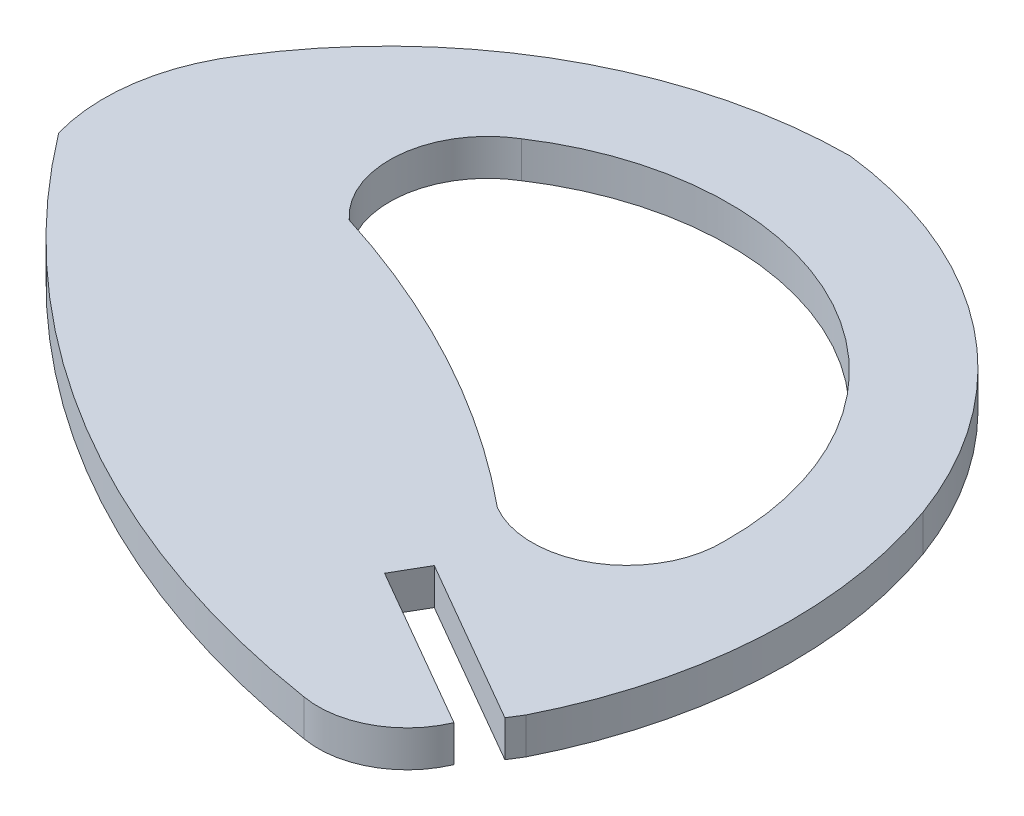
ISO-10303-21;
HEADER;
FILE_DESCRIPTION(('STEP AP214'),'2;1');
FILE_NAME('part.step','',(''),(''),'','','');
FILE_SCHEMA(('AUTOMOTIVE_DESIGN { 1 0 10303 214 1 1 1 1 }'));
ENDSEC;
DATA;
#1=APPLICATION_CONTEXT('core data for automotive mechanical design processes');
#2=APPLICATION_PROTOCOL_DEFINITION('international standard','automotive_design',2000,#1);
#3=PRODUCT_CONTEXT('',#1,'mechanical');
#4=PRODUCT('Part','Part','',(#3));
#5=PRODUCT_RELATED_PRODUCT_CATEGORY('part','',(#4));
#6=PRODUCT_DEFINITION_FORMATION('','',#4);
#7=PRODUCT_DEFINITION_CONTEXT('part definition',#1,'design');
#8=PRODUCT_DEFINITION('design','',#6,#7);
#9=PRODUCT_DEFINITION_SHAPE('','',#8);
#10=(LENGTH_UNIT() NAMED_UNIT(*) SI_UNIT(.MILLI.,.METRE.));
#11=(NAMED_UNIT(*) PLANE_ANGLE_UNIT() SI_UNIT($,.RADIAN.));
#12=(NAMED_UNIT(*) SI_UNIT($,.STERADIAN.) SOLID_ANGLE_UNIT());
#13=UNCERTAINTY_MEASURE_WITH_UNIT(LENGTH_MEASURE(1.E-05),#10,'distance_accuracy_value','');
#14=(GEOMETRIC_REPRESENTATION_CONTEXT(3) GLOBAL_UNCERTAINTY_ASSIGNED_CONTEXT((#13)) GLOBAL_UNIT_ASSIGNED_CONTEXT((#10,
#11,#12)) REPRESENTATION_CONTEXT('',''));
#15=CARTESIAN_POINT('',(0.,0.,0.));
#16=DIRECTION('',(0.,0.,1.));
#17=DIRECTION('',(1.,0.,0.));
#18=AXIS2_PLACEMENT_3D('',#15,#16,#17);
#19=CARTESIAN_POINT('',(-169.809632461786,2.,-546.333498523849));
#20=DIRECTION('',(0.,-1.,0.));
#21=DIRECTION('',(0.,0.,-1.));
#22=AXIS2_PLACEMENT_3D('',#19,#20,#21);
#23=CYLINDRICAL_SURFACE('',#22,5.21588019900001);
#24=CARTESIAN_POINT('',(-169.809632461786,0.,-546.333498523849));
#25=DIRECTION('',(0.,1.,0.));
#26=DIRECTION('',(0.,0.,1.));
#27=AXIS2_PLACEMENT_3D('',#24,#25,#26);
#28=CIRCLE('',#27,5.21588019900001);
#29=CARTESIAN_POINT('',(-172.430720000013,0.,-541.824030000035));
#30=VERTEX_POINT('',#29);
#31=CARTESIAN_POINT('',(-164.59713000003,0.,-546.521180000064));
#32=VERTEX_POINT('',#31);
#33=EDGE_CURVE('E214',#30,#32,#28,.T.);
#34=ORIENTED_EDGE('',*,*,#33,.F.);
#35=DIRECTION('',(0.,-1.,0.));
#36=VECTOR('',#35,1.);
#37=CARTESIAN_POINT('',(-172.430720000013,2.,-541.824030000035));
#38=LINE('',#37,#36);
#39=CARTESIAN_POINT('',(-172.430720000013,2.,-541.824030000035));
#40=VERTEX_POINT('',#39);
#41=EDGE_CURVE('E261',#40,#30,#38,.T.);
#42=ORIENTED_EDGE('',*,*,#41,.F.);
#43=CARTESIAN_POINT('',(-169.809632461786,2.,-546.333498523849));
#44=DIRECTION('',(0.,1.,0.));
#45=DIRECTION('',(0.,0.,1.));
#46=AXIS2_PLACEMENT_3D('',#43,#44,#45);
#47=CIRCLE('',#46,5.21588019900001);
#48=CARTESIAN_POINT('',(-164.59713000003,2.,-546.521180000064));
#49=VERTEX_POINT('',#48);
#50=EDGE_CURVE('E183',#40,#49,#47,.T.);
#51=ORIENTED_EDGE('',*,*,#50,.T.);
#52=DIRECTION('',(0.,-1.,0.));
#53=VECTOR('',#52,1.);
#54=CARTESIAN_POINT('',(-164.59713000003,2.,-546.521180000064));
#55=LINE('',#54,#53);
#56=EDGE_CURVE('E111',#49,#32,#55,.T.);
#57=ORIENTED_EDGE('',*,*,#56,.T.);
#58=EDGE_LOOP('',(#34,#42,#51,#57));
#59=FACE_BOUND('',#58,.T.);
#60=ADVANCED_FACE('F37',(#59),#23,.F.);
#61=CARTESIAN_POINT('',(-206.134761367948,2.,-500.817361571184));
#62=DIRECTION('',(0.,-1.,0.));
#63=DIRECTION('',(0.,0.,-1.));
#64=AXIS2_PLACEMENT_3D('',#61,#62,#63);
#65=CYLINDRICAL_SURFACE('',#64,53.0802153364624);
#66=CARTESIAN_POINT('',(-206.134761367948,0.,-500.817361571184));
#67=DIRECTION('',(0.,1.,0.));
#68=DIRECTION('',(0.,0.,1.));
#69=AXIS2_PLACEMENT_3D('',#66,#67,#68);
#70=CIRCLE('',#69,53.0802153364624);
#71=CARTESIAN_POINT('',(-190.212509999962,0.,-551.453229999995));
#72=VERTEX_POINT('',#71);
#73=EDGE_CURVE('E207',#30,#72,#70,.T.);
#74=ORIENTED_EDGE('',*,*,#73,.T.);
#75=DIRECTION('',(0.,-1.,0.));
#76=VECTOR('',#75,1.);
#77=CARTESIAN_POINT('',(-190.212509999962,2.,-551.453229999995));
#78=LINE('',#77,#76);
#79=CARTESIAN_POINT('',(-190.212509999962,2.,-551.453229999995));
#80=VERTEX_POINT('',#79);
#81=EDGE_CURVE('E263',#80,#72,#78,.T.);
#82=ORIENTED_EDGE('',*,*,#81,.F.);
#83=CARTESIAN_POINT('',(-206.134761367948,2.,-500.817361571184));
#84=DIRECTION('',(0.,1.,0.));
#85=DIRECTION('',(0.,0.,1.));
#86=AXIS2_PLACEMENT_3D('',#83,#84,#85);
#87=CIRCLE('',#86,53.0802153364624);
#88=EDGE_CURVE('E181',#40,#80,#87,.T.);
#89=ORIENTED_EDGE('',*,*,#88,.F.);
#90=ORIENTED_EDGE('',*,*,#41,.T.);
#91=EDGE_LOOP('',(#74,#82,#89,#90));
#92=FACE_BOUND('',#91,.T.);
#93=ADVANCED_FACE('F291',(#92),#65,.T.);
#94=CARTESIAN_POINT('',(-186.578179291638,2.,-555.438367080781));
#95=DIRECTION('',(0.,-1.,0.));
#96=DIRECTION('',(0.,0.,-1.));
#97=AXIS2_PLACEMENT_3D('',#94,#95,#96);
#98=CYLINDRICAL_SURFACE('',#97,5.39348470380004);
#99=CARTESIAN_POINT('',(-186.578179291638,0.,-555.438367080781));
#100=DIRECTION('',(0.,1.,0.));
#101=DIRECTION('',(0.,0.,1.));
#102=AXIS2_PLACEMENT_3D('',#99,#100,#101);
#103=CIRCLE('',#102,5.39348470380004);
#104=CARTESIAN_POINT('',(-189.351039999988,0.,-560.064480000091));
#105=VERTEX_POINT('',#104);
#106=EDGE_CURVE('E203',#105,#72,#103,.T.);
#107=ORIENTED_EDGE('',*,*,#106,.F.);
#108=DIRECTION('',(0.,-1.,0.));
#109=VECTOR('',#108,1.);
#110=CARTESIAN_POINT('',(-189.351039999988,2.,-560.064480000091));
#111=LINE('',#110,#109);
#112=CARTESIAN_POINT('',(-189.351039999988,2.,-560.064480000091));
#113=VERTEX_POINT('',#112);
#114=EDGE_CURVE('E264',#113,#105,#111,.T.);
#115=ORIENTED_EDGE('',*,*,#114,.F.);
#116=CARTESIAN_POINT('',(-186.578179291638,2.,-555.438367080781));
#117=DIRECTION('',(0.,1.,0.));
#118=DIRECTION('',(0.,0.,1.));
#119=AXIS2_PLACEMENT_3D('',#116,#117,#118);
#120=CIRCLE('',#119,5.39348470380004);
#121=EDGE_CURVE('E177',#113,#80,#120,.T.);
#122=ORIENTED_EDGE('',*,*,#121,.T.);
#123=ORIENTED_EDGE('',*,*,#81,.T.);
#124=EDGE_LOOP('',(#107,#115,#122,#123));
#125=FACE_BOUND('',#124,.T.);
#126=ADVANCED_FACE('F284',(#125),#98,.F.);
#127=CARTESIAN_POINT('',(-160.656271892859,2.,-579.141541133194));
#128=DIRECTION('',(0.,-1.,0.));
#129=DIRECTION('',(0.,0.,-1.));
#130=AXIS2_PLACEMENT_3D('',#127,#128,#129);
#131=CYLINDRICAL_SURFACE('',#130,52.2736980832);
#132=CARTESIAN_POINT('',(-160.656271892859,0.,-579.141541133194));
#133=DIRECTION('',(0.,1.,0.));
#134=DIRECTION('',(0.,0.,1.));
#135=AXIS2_PLACEMENT_3D('',#132,#133,#134);
#136=CIRCLE('',#135,52.2736980832);
#137=CARTESIAN_POINT('',(-202.354560000017,0.,-547.617070000025));
#138=VERTEX_POINT('',#137);
#139=CARTESIAN_POINT('',(-168.74882000001,0.,-527.498049999973));
#140=VERTEX_POINT('',#139);
#141=EDGE_CURVE('E11',#138,#140,#136,.T.);
#142=ORIENTED_EDGE('',*,*,#141,.T.);
#143=DIRECTION('',(0.,-1.,0.));
#144=VECTOR('',#143,1.);
#145=CARTESIAN_POINT('',(-168.74882000001,2.,-527.498049999973));
#146=LINE('',#145,#144);
#147=CARTESIAN_POINT('',(-168.74882000001,2.,-527.498049999973));
#148=VERTEX_POINT('',#147);
#149=EDGE_CURVE('E267',#148,#140,#146,.T.);
#150=ORIENTED_EDGE('',*,*,#149,.F.);
#151=CARTESIAN_POINT('',(-160.656271892859,2.,-579.141541133194));
#152=DIRECTION('',(0.,1.,0.));
#153=DIRECTION('',(0.,0.,1.));
#154=AXIS2_PLACEMENT_3D('',#151,#152,#153);
#155=CIRCLE('',#154,52.2736980832);
#156=CARTESIAN_POINT('',(-202.354560000017,2.,-547.617070000025));
#157=VERTEX_POINT('',#156);
#158=EDGE_CURVE('E41',#157,#148,#155,.T.);
#159=ORIENTED_EDGE('',*,*,#158,.F.);
#160=DIRECTION('',(0.,-1.,0.));
#161=VECTOR('',#160,1.);
#162=CARTESIAN_POINT('',(-202.354560000017,2.,-547.617070000025));
#163=LINE('',#162,#161);
#164=EDGE_CURVE('E178',#157,#138,#163,.T.);
#165=ORIENTED_EDGE('',*,*,#164,.T.);
#166=EDGE_LOOP('',(#142,#150,#159,#165));
#167=FACE_BOUND('',#166,.T.);
#168=ADVANCED_FACE('F281',(#167),#131,.T.);
#169=CARTESIAN_POINT('',(-167.887067589715,2.,-532.310121301565));
#170=DIRECTION('',(0.,-1.,0.));
#171=DIRECTION('',(0.,0.,-1.));
#172=AXIS2_PLACEMENT_3D('',#169,#170,#171);
#173=CYLINDRICAL_SURFACE('',#172,4.88862428790002);
#174=CARTESIAN_POINT('',(-167.887067589715,0.,-532.310121301565));
#175=DIRECTION('',(0.,1.,0.));
#176=DIRECTION('',(0.,0.,1.));
#177=AXIS2_PLACEMENT_3D('',#174,#175,#176);
#178=CIRCLE('',#177,4.88862428790002);
#179=CARTESIAN_POINT('',(-163.390679999997,0.,-530.391490000017));
#180=VERTEX_POINT('',#179);
#181=EDGE_CURVE('E47',#140,#180,#178,.T.);
#182=ORIENTED_EDGE('',*,*,#181,.T.);
#183=DIRECTION('',(0.,-1.,0.));
#184=VECTOR('',#183,1.);
#185=CARTESIAN_POINT('',(-163.390679999997,2.,-530.391490000017));
#186=LINE('',#185,#184);
#187=CARTESIAN_POINT('',(-163.390679999997,2.,-530.391490000017));
#188=VERTEX_POINT('',#187);
#189=EDGE_CURVE('E152',#188,#180,#186,.T.);
#190=ORIENTED_EDGE('',*,*,#189,.F.);
#191=CARTESIAN_POINT('',(-167.887067589715,2.,-532.310121301565));
#192=DIRECTION('',(0.,1.,0.));
#193=DIRECTION('',(0.,0.,1.));
#194=AXIS2_PLACEMENT_3D('',#191,#192,#193);
#195=CIRCLE('',#194,4.88862428790002);
#196=EDGE_CURVE('E101',#148,#188,#195,.T.);
#197=ORIENTED_EDGE('',*,*,#196,.F.);
#198=ORIENTED_EDGE('',*,*,#149,.T.);
#199=EDGE_LOOP('',(#182,#190,#197,#198));
#200=FACE_BOUND('',#199,.T.);
#201=ADVANCED_FACE('F283',(#200),#173,.T.);
#202=CARTESIAN_POINT('',(-453.30566983731,2.,-697.805518818235));
#203=DIRECTION('',(-0.500070637237934,0.,0.865984617514911));
#204=DIRECTION('',(0.865984617514911,0.,0.500070637237934));
#205=AXIS2_PLACEMENT_3D('',#202,#203,#204);
#206=PLANE('',#205);
#207=DIRECTION('',(-0.865984617514911,0.,-0.500070637237934));
#208=VECTOR('',#207,1.);
#209=CARTESIAN_POINT('',(-453.30566983731,0.,-697.805518818235));
#210=LINE('',#209,#208);
#211=CARTESIAN_POINT('',(-172.41558,0.,-535.603));
#212=VERTEX_POINT('',#211);
#213=EDGE_CURVE('E146',#180,#212,#210,.T.);
#214=ORIENTED_EDGE('',*,*,#213,.T.);
#215=DIRECTION('',(0.,-1.,0.));
#216=VECTOR('',#215,1.);
#217=CARTESIAN_POINT('',(-172.41558,2.,-535.603));
#218=LINE('',#217,#216);
#219=CARTESIAN_POINT('',(-172.41558,2.,-535.603));
#220=VERTEX_POINT('',#219);
#221=EDGE_CURVE('E150',#220,#212,#218,.T.);
#222=ORIENTED_EDGE('',*,*,#221,.F.);
#223=DIRECTION('',(-0.865984617514911,0.,-0.500070637237934));
#224=VECTOR('',#223,1.);
#225=CARTESIAN_POINT('',(-453.30566983731,2.,-697.805518818235));
#226=LINE('',#225,#224);
#227=EDGE_CURVE('E198',#188,#220,#226,.T.);
#228=ORIENTED_EDGE('',*,*,#227,.F.);
#229=ORIENTED_EDGE('',*,*,#189,.T.);
#230=EDGE_LOOP('',(#214,#222,#228,#229));
#231=FACE_BOUND('',#230,.T.);
#232=ADVANCED_FACE('F148',(#231),#206,.F.);
#233=CARTESIAN_POINT('',(-244.9793983781,2.,-409.942235990643));
#234=DIRECTION('',(-0.865984989121065,0.,-0.500069993717869));
#235=DIRECTION('',(-0.500069993717869,0.,0.865984989121065));
#236=AXIS2_PLACEMENT_3D('',#233,#234,#235);
#237=PLANE('',#236);
#238=DIRECTION('',(0.500069993717869,0.,-0.865984989121065));
#239=VECTOR('',#238,1.);
#240=CARTESIAN_POINT('',(-244.9793983781,0.,-409.942235990643));
#241=LINE('',#240,#239);
#242=CARTESIAN_POINT('',(-171.41544,0.,-537.33497));
#243=VERTEX_POINT('',#242);
#244=EDGE_CURVE('E154',#212,#243,#241,.T.);
#245=ORIENTED_EDGE('',*,*,#244,.T.);
#246=DIRECTION('',(0.,-1.,0.));
#247=VECTOR('',#246,1.);
#248=CARTESIAN_POINT('',(-171.41544,2.,-537.33497));
#249=LINE('',#248,#247);
#250=CARTESIAN_POINT('',(-171.41544,2.,-537.33497));
#251=VERTEX_POINT('',#250);
#252=EDGE_CURVE('E161',#251,#243,#249,.T.);
#253=ORIENTED_EDGE('',*,*,#252,.F.);
#254=DIRECTION('',(0.500069993717869,0.,-0.865984989121065));
#255=VECTOR('',#254,1.);
#256=CARTESIAN_POINT('',(-244.9793983781,2.,-409.942235990643));
#257=LINE('',#256,#255);
#258=EDGE_CURVE('E160',#220,#251,#257,.T.);
#259=ORIENTED_EDGE('',*,*,#258,.F.);
#260=ORIENTED_EDGE('',*,*,#221,.T.);
#261=EDGE_LOOP('',(#245,#253,#259,#260));
#262=FACE_BOUND('',#261,.T.);
#263=ADVANCED_FACE('F157',(#262),#237,.F.);
#264=CARTESIAN_POINT('',(-452.305382681157,2.,-699.537592504908));
#265=DIRECTION('',(0.500071073433887,0.,-0.865984365629472));
#266=DIRECTION('',(-0.865984365629472,0.,-0.500071073433887));
#267=AXIS2_PLACEMENT_3D('',#264,#265,#266);
#268=PLANE('',#267);
#269=DIRECTION('',(0.865984365629472,0.,0.500071073433887));
#270=VECTOR('',#269,1.);
#271=CARTESIAN_POINT('',(-452.305382681157,0.,-699.537592504908));
#272=LINE('',#271,#270);
#273=CARTESIAN_POINT('',(-162.22337,0.,-532.02692));
#274=VERTEX_POINT('',#273);
#275=EDGE_CURVE('E167',#243,#274,#272,.T.);
#276=ORIENTED_EDGE('',*,*,#275,.T.);
#277=DIRECTION('',(0.,-1.,0.));
#278=VECTOR('',#277,1.);
#279=CARTESIAN_POINT('',(-162.22337,2.,-532.02692));
#280=LINE('',#279,#278);
#281=CARTESIAN_POINT('',(-162.22337,2.,-532.02692));
#282=VERTEX_POINT('',#281);
#283=EDGE_CURVE('E232',#282,#274,#280,.T.);
#284=ORIENTED_EDGE('',*,*,#283,.F.);
#285=DIRECTION('',(0.865984365629472,0.,0.500071073433887));
#286=VECTOR('',#285,1.);
#287=CARTESIAN_POINT('',(-452.305382681157,2.,-699.537592504908));
#288=LINE('',#287,#286);
#289=EDGE_CURVE('E195',#251,#282,#288,.T.);
#290=ORIENTED_EDGE('',*,*,#289,.F.);
#291=ORIENTED_EDGE('',*,*,#252,.T.);
#292=EDGE_LOOP('',(#276,#284,#290,#291));
#293=FACE_BOUND('',#292,.T.);
#294=ADVANCED_FACE('F274',(#293),#268,.F.);
#295=CARTESIAN_POINT('',(-246.004335878205,2.,-397.652124536467));
#296=DIRECTION('',(-0.848574753543305,0.,-0.529075502786624));
#297=DIRECTION('',(-0.529075502786624,0.,0.848574753543305));
#298=AXIS2_PLACEMENT_3D('',#295,#296,#297);
#299=PLANE('',#298);
#300=DIRECTION('',(0.529075502786624,0.,-0.848574753543305));
#301=VECTOR('',#300,1.);
#302=CARTESIAN_POINT('',(-246.004335878205,0.,-397.652124536467));
#303=LINE('',#302,#301);
#304=CARTESIAN_POINT('',(-161.776709999994,0.,-532.743309999965));
#305=VERTEX_POINT('',#304);
#306=EDGE_CURVE('E169',#274,#305,#303,.T.);
#307=ORIENTED_EDGE('',*,*,#306,.T.);
#308=DIRECTION('',(0.,-1.,0.));
#309=VECTOR('',#308,1.);
#310=CARTESIAN_POINT('',(-161.776709999994,2.,-532.743309999965));
#311=LINE('',#310,#309);
#312=CARTESIAN_POINT('',(-161.776709999994,2.,-532.743309999965));
#313=VERTEX_POINT('',#312);
#314=EDGE_CURVE('E229',#313,#305,#311,.T.);
#315=ORIENTED_EDGE('',*,*,#314,.F.);
#316=DIRECTION('',(0.529075502786624,0.,-0.848574753543305));
#317=VECTOR('',#316,1.);
#318=CARTESIAN_POINT('',(-246.004335878205,2.,-397.652124536467));
#319=LINE('',#318,#317);
#320=EDGE_CURVE('E193',#282,#313,#319,.T.);
#321=ORIENTED_EDGE('',*,*,#320,.F.);
#322=ORIENTED_EDGE('',*,*,#283,.T.);
#323=EDGE_LOOP('',(#307,#315,#321,#322));
#324=FACE_BOUND('',#323,.T.);
#325=ADVANCED_FACE('F227',(#324),#299,.F.);
#326=CARTESIAN_POINT('',(-185.1513699245,2.,-544.498431241));
#327=DIRECTION('',(0.,-1.,0.));
#328=DIRECTION('',(0.,0.,-1.));
#329=AXIS2_PLACEMENT_3D('',#326,#327,#328);
#330=CYLINDRICAL_SURFACE('',#329,26.1640517118);
#331=CARTESIAN_POINT('',(-185.1513699245,0.,-544.498431241));
#332=DIRECTION('',(0.,1.,0.));
#333=DIRECTION('',(0.,0.,1.));
#334=AXIS2_PLACEMENT_3D('',#331,#332,#333);
#335=CIRCLE('',#334,26.1640517118);
#336=CARTESIAN_POINT('',(-160.523559999984,0.,-553.331809999984));
#337=VERTEX_POINT('',#336);
#338=EDGE_CURVE('E222',#305,#337,#335,.T.);
#339=ORIENTED_EDGE('',*,*,#338,.T.);
#340=DIRECTION('',(0.,-1.,0.));
#341=VECTOR('',#340,1.);
#342=CARTESIAN_POINT('',(-160.523559999984,2.,-553.331809999984));
#343=LINE('',#342,#341);
#344=CARTESIAN_POINT('',(-160.523559999984,2.,-553.331809999984));
#345=VERTEX_POINT('',#344);
#346=EDGE_CURVE('E238',#345,#337,#343,.T.);
#347=ORIENTED_EDGE('',*,*,#346,.F.);
#348=CARTESIAN_POINT('',(-185.1513699245,2.,-544.498431241));
#349=DIRECTION('',(0.,1.,0.));
#350=DIRECTION('',(0.,0.,1.));
#351=AXIS2_PLACEMENT_3D('',#348,#349,#350);
#352=CIRCLE('',#351,26.1640517118);
#353=EDGE_CURVE('E191',#313,#345,#352,.T.);
#354=ORIENTED_EDGE('',*,*,#353,.F.);
#355=ORIENTED_EDGE('',*,*,#314,.T.);
#356=EDGE_LOOP('',(#339,#347,#354,#355));
#357=FACE_BOUND('',#356,.T.);
#358=ADVANCED_FACE('F235',(#357),#330,.T.);
#359=CARTESIAN_POINT('',(-182.159072980183,2.,-545.395112350598));
#360=DIRECTION('',(0.,-1.,0.));
#361=DIRECTION('',(0.,0.,-1.));
#362=AXIS2_PLACEMENT_3D('',#359,#360,#361);
#363=CYLINDRICAL_SURFACE('',#362,23.0453160424);
#364=CARTESIAN_POINT('',(-182.159072980183,0.,-545.395112350598));
#365=DIRECTION('',(0.,1.,0.));
#366=DIRECTION('',(0.,0.,1.));
#367=AXIS2_PLACEMENT_3D('',#364,#365,#366);
#368=CIRCLE('',#367,23.0453160424);
#369=CARTESIAN_POINT('',(-179.480390000026,0.,-568.28422));
#370=VERTEX_POINT('',#369);
#371=EDGE_CURVE('E220',#337,#370,#368,.T.);
#372=ORIENTED_EDGE('',*,*,#371,.T.);
#373=DIRECTION('',(0.,-1.,0.));
#374=VECTOR('',#373,1.);
#375=CARTESIAN_POINT('',(-179.480390000026,2.,-568.28422));
#376=LINE('',#375,#374);
#377=CARTESIAN_POINT('',(-179.480390000026,2.,-568.28422));
#378=VERTEX_POINT('',#377);
#379=EDGE_CURVE('E248',#378,#370,#376,.T.);
#380=ORIENTED_EDGE('',*,*,#379,.F.);
#381=CARTESIAN_POINT('',(-182.159072980183,2.,-545.395112350598));
#382=DIRECTION('',(0.,1.,0.));
#383=DIRECTION('',(0.,0.,1.));
#384=AXIS2_PLACEMENT_3D('',#381,#382,#383);
#385=CIRCLE('',#384,23.0453160424);
#386=EDGE_CURVE('E189',#345,#378,#385,.T.);
#387=ORIENTED_EDGE('',*,*,#386,.F.);
#388=ORIENTED_EDGE('',*,*,#346,.T.);
#389=EDGE_LOOP('',(#372,#380,#387,#388));
#390=FACE_BOUND('',#389,.T.);
#391=ADVANCED_FACE('F246',(#390),#363,.T.);
#392=CARTESIAN_POINT('',(-179.3672066552,2.,-542.719311859701));
#393=DIRECTION('',(0.,-1.,0.));
#394=DIRECTION('',(0.,0.,-1.));
#395=AXIS2_PLACEMENT_3D('',#392,#393,#394);
#396=CYLINDRICAL_SURFACE('',#395,25.5651586870001);
#397=CARTESIAN_POINT('',(-179.3672066552,0.,-542.719311859701));
#398=DIRECTION('',(0.,1.,0.));
#399=DIRECTION('',(0.,0.,1.));
#400=AXIS2_PLACEMENT_3D('',#397,#398,#399);
#401=CIRCLE('',#400,25.5651586870001);
#402=CARTESIAN_POINT('',(-201.022739999962,0.,-556.306629999988));
#403=VERTEX_POINT('',#402);
#404=EDGE_CURVE('E218',#370,#403,#401,.T.);
#405=ORIENTED_EDGE('',*,*,#404,.T.);
#406=DIRECTION('',(0.,-1.,0.));
#407=VECTOR('',#406,1.);
#408=CARTESIAN_POINT('',(-201.022739999962,2.,-556.306629999988));
#409=LINE('',#408,#407);
#410=CARTESIAN_POINT('',(-201.022739999962,2.,-556.306629999988));
#411=VERTEX_POINT('',#410);
#412=EDGE_CURVE('E254',#411,#403,#409,.T.);
#413=ORIENTED_EDGE('',*,*,#412,.F.);
#414=CARTESIAN_POINT('',(-179.3672066552,2.,-542.719311859701));
#415=DIRECTION('',(0.,1.,0.));
#416=DIRECTION('',(0.,0.,1.));
#417=AXIS2_PLACEMENT_3D('',#414,#415,#416);
#418=CIRCLE('',#417,25.5651586870001);
#419=EDGE_CURVE('E187',#378,#411,#418,.T.);
#420=ORIENTED_EDGE('',*,*,#419,.F.);
#421=ORIENTED_EDGE('',*,*,#379,.T.);
#422=EDGE_LOOP('',(#405,#413,#420,#421));
#423=FACE_BOUND('',#422,.T.);
#424=ADVANCED_FACE('F251',(#423),#396,.T.);
#425=CARTESIAN_POINT('',(-192.188769259475,2.,-550.505834831412));
#426=DIRECTION('',(0.,-1.,0.));
#427=DIRECTION('',(0.,0.,-1.));
#428=AXIS2_PLACEMENT_3D('',#425,#426,#427);
#429=CYLINDRICAL_SURFACE('',#428,10.5682668225);
#430=CARTESIAN_POINT('',(-192.188769259475,0.,-550.505834831412));
#431=DIRECTION('',(0.,1.,0.));
#432=DIRECTION('',(0.,0.,1.));
#433=AXIS2_PLACEMENT_3D('',#430,#431,#432);
#434=CIRCLE('',#433,10.5682668225);
#435=EDGE_CURVE('E216',#403,#138,#434,.T.);
#436=ORIENTED_EDGE('',*,*,#435,.T.);
#437=ORIENTED_EDGE('',*,*,#164,.F.);
#438=CARTESIAN_POINT('',(-192.188769259475,2.,-550.505834831412));
#439=DIRECTION('',(0.,1.,0.));
#440=DIRECTION('',(0.,0.,1.));
#441=AXIS2_PLACEMENT_3D('',#438,#439,#440);
#442=CIRCLE('',#441,10.5682668225);
#443=EDGE_CURVE('E185',#411,#157,#442,.T.);
#444=ORIENTED_EDGE('',*,*,#443,.F.);
#445=ORIENTED_EDGE('',*,*,#412,.T.);
#446=EDGE_LOOP('',(#436,#437,#444,#445));
#447=FACE_BOUND('',#446,.T.);
#448=ADVANCED_FACE('F279',(#447),#429,.T.);
#449=CARTESIAN_POINT('',(-180.562644461589,2.,-546.73380244097));
#450=DIRECTION('',(0.,-1.,0.));
#451=DIRECTION('',(0.,0.,-1.));
#452=AXIS2_PLACEMENT_3D('',#449,#450,#451);
#453=CYLINDRICAL_SURFACE('',#452,15.9669302098);
#454=CARTESIAN_POINT('',(-180.562644461589,0.,-546.73380244097));
#455=DIRECTION('',(0.,1.,0.));
#456=DIRECTION('',(0.,0.,1.));
#457=AXIS2_PLACEMENT_3D('',#454,#455,#456);
#458=CIRCLE('',#457,15.9669302098);
#459=EDGE_CURVE('E199',#32,#105,#458,.T.);
#460=ORIENTED_EDGE('',*,*,#459,.F.);
#461=ORIENTED_EDGE('',*,*,#56,.F.);
#462=CARTESIAN_POINT('',(-180.562644461589,2.,-546.73380244097));
#463=DIRECTION('',(0.,1.,0.));
#464=DIRECTION('',(0.,0.,1.));
#465=AXIS2_PLACEMENT_3D('',#462,#463,#464);
#466=CIRCLE('',#465,15.9669302098);
#467=EDGE_CURVE('E174',#49,#113,#466,.T.);
#468=ORIENTED_EDGE('',*,*,#467,.T.);
#469=ORIENTED_EDGE('',*,*,#114,.T.);
#470=EDGE_LOOP('',(#460,#461,#468,#469));
#471=FACE_BOUND('',#470,.T.);
#472=ADVANCED_FACE('F304',(#471),#453,.F.);
#473=CARTESIAN_POINT('',(-525.869702128861,2.,-572.1446));
#474=DIRECTION('',(0.,1.,0.));
#475=DIRECTION('',(0.,0.,1.));
#476=AXIS2_PLACEMENT_3D('',#473,#474,#475);
#477=PLANE('',#476);
#478=ORIENTED_EDGE('',*,*,#158,.T.);
#479=ORIENTED_EDGE('',*,*,#196,.T.);
#480=ORIENTED_EDGE('',*,*,#227,.T.);
#481=ORIENTED_EDGE('',*,*,#258,.T.);
#482=ORIENTED_EDGE('',*,*,#289,.T.);
#483=ORIENTED_EDGE('',*,*,#320,.T.);
#484=ORIENTED_EDGE('',*,*,#353,.T.);
#485=ORIENTED_EDGE('',*,*,#386,.T.);
#486=ORIENTED_EDGE('',*,*,#419,.T.);
#487=ORIENTED_EDGE('',*,*,#443,.T.);
#488=EDGE_LOOP('',(#478,#479,#480,#481,#482,#483,#484,#485,#486,#487));
#489=FACE_BOUND('',#488,.T.);
#490=ORIENTED_EDGE('',*,*,#50,.F.);
#491=ORIENTED_EDGE('',*,*,#88,.T.);
#492=ORIENTED_EDGE('',*,*,#121,.F.);
#493=ORIENTED_EDGE('',*,*,#467,.F.);
#494=EDGE_LOOP('',(#490,#491,#492,#493));
#495=FACE_BOUND('',#494,.T.);
#496=ADVANCED_FACE('F39',(#489,#495),#477,.T.);
#497=CARTESIAN_POINT('',(-525.869702128861,0.,-572.1446));
#498=DIRECTION('',(0.,1.,0.));
#499=DIRECTION('',(0.,0.,1.));
#500=AXIS2_PLACEMENT_3D('',#497,#498,#499);
#501=PLANE('',#500);
#502=ORIENTED_EDGE('',*,*,#141,.F.);
#503=ORIENTED_EDGE('',*,*,#435,.F.);
#504=ORIENTED_EDGE('',*,*,#404,.F.);
#505=ORIENTED_EDGE('',*,*,#371,.F.);
#506=ORIENTED_EDGE('',*,*,#338,.F.);
#507=ORIENTED_EDGE('',*,*,#306,.F.);
#508=ORIENTED_EDGE('',*,*,#275,.F.);
#509=ORIENTED_EDGE('',*,*,#244,.F.);
#510=ORIENTED_EDGE('',*,*,#213,.F.);
#511=ORIENTED_EDGE('',*,*,#181,.F.);
#512=EDGE_LOOP('',(#502,#503,#504,#505,#506,#507,#508,#509,#510,#511));
#513=FACE_BOUND('',#512,.T.);
#514=ORIENTED_EDGE('',*,*,#33,.T.);
#515=ORIENTED_EDGE('',*,*,#459,.T.);
#516=ORIENTED_EDGE('',*,*,#106,.T.);
#517=ORIENTED_EDGE('',*,*,#73,.F.);
#518=EDGE_LOOP('',(#514,#515,#516,#517));
#519=FACE_BOUND('',#518,.T.);
#520=ADVANCED_FACE('F164',(#513,#519),#501,.F.);
#521=CLOSED_SHELL('',(#60,#93,#126,#168,#201,#232,#263,#294,#325,#358,#391,#424,#448,#472,#496,#520));
#522=MANIFOLD_SOLID_BREP('B2',#521);
#523=ADVANCED_BREP_SHAPE_REPRESENTATION('',(#18,#522),#14);
#524=SHAPE_DEFINITION_REPRESENTATION(#9,#523);
ENDSEC;
END-ISO-10303-21;
